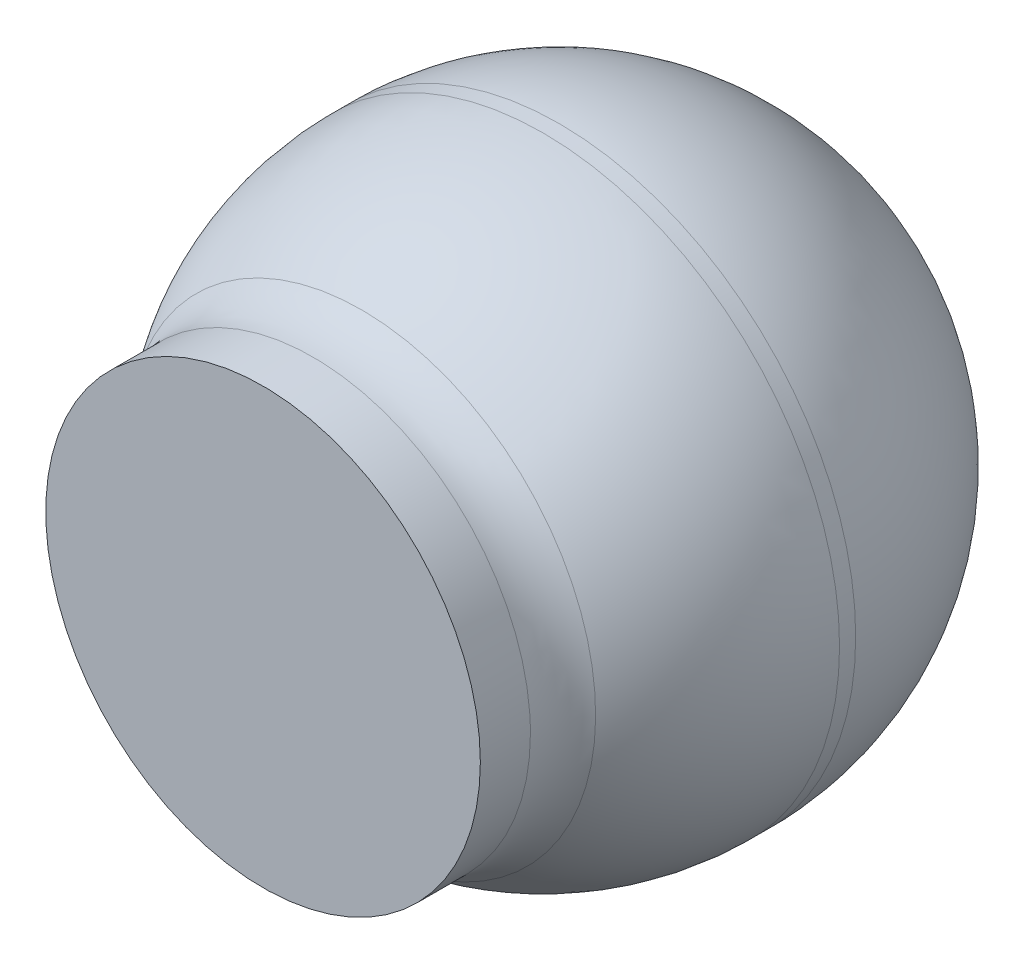
ISO-10303-21;
HEADER;
FILE_DESCRIPTION(('STEP AP214'),'2;1');
FILE_NAME('part.step','',(''),(''),'','','');
FILE_SCHEMA(('AUTOMOTIVE_DESIGN { 1 0 10303 214 1 1 1 1 }'));
ENDSEC;
DATA;
#1=APPLICATION_CONTEXT('core data for automotive mechanical design processes');
#2=APPLICATION_PROTOCOL_DEFINITION('international standard','automotive_design',2000,#1);
#3=PRODUCT_CONTEXT('',#1,'mechanical');
#4=PRODUCT('Part','Part','',(#3));
#5=PRODUCT_RELATED_PRODUCT_CATEGORY('part','',(#4));
#6=PRODUCT_DEFINITION_FORMATION('','',#4);
#7=PRODUCT_DEFINITION_CONTEXT('part definition',#1,'design');
#8=PRODUCT_DEFINITION('design','',#6,#7);
#9=PRODUCT_DEFINITION_SHAPE('','',#8);
#10=(LENGTH_UNIT() NAMED_UNIT(*) SI_UNIT(.MILLI.,.METRE.));
#11=(NAMED_UNIT(*) PLANE_ANGLE_UNIT() SI_UNIT($,.RADIAN.));
#12=(NAMED_UNIT(*) SI_UNIT($,.STERADIAN.) SOLID_ANGLE_UNIT());
#13=UNCERTAINTY_MEASURE_WITH_UNIT(LENGTH_MEASURE(1.E-05),#10,'distance_accuracy_value','');
#14=(GEOMETRIC_REPRESENTATION_CONTEXT(3) GLOBAL_UNCERTAINTY_ASSIGNED_CONTEXT((#13)) GLOBAL_UNIT_ASSIGNED_CONTEXT((#10,
#11,#12)) REPRESENTATION_CONTEXT('',''));
#15=CARTESIAN_POINT('',(0.,0.,0.));
#16=DIRECTION('',(0.,0.,1.));
#17=DIRECTION('',(1.,0.,0.));
#18=AXIS2_PLACEMENT_3D('',#15,#16,#17);
#19=CARTESIAN_POINT('',(-5.642919922269,-2.781349291452,10.006534503384));
#20=DIRECTION('',(0.,0.,-1.));
#21=DIRECTION('',(-1.,0.,0.));
#22=AXIS2_PLACEMENT_3D('',#19,#20,#21);
#23=PLANE('',#22);
#24=CARTESIAN_POINT('',(-5.642919922269,-2.781349291452,10.006534503384));
#25=DIRECTION('',(0.,0.,1.));
#26=DIRECTION('',(1.,0.,0.));
#27=AXIS2_PLACEMENT_3D('',#24,#25,#26);
#28=CIRCLE('',#27,0.275);
#29=CARTESIAN_POINT('',(-5.367919922269,-2.781349291452,10.006534503384));
#30=VERTEX_POINT('',#29);
#31=EDGE_CURVE('E20',#30,#30,#28,.F.);
#32=ORIENTED_EDGE('',*,*,#31,.F.);
#33=EDGE_LOOP('',(#32));
#34=FACE_BOUND('',#33,.T.);
#35=ADVANCED_FACE('F17',(#34),#23,.F.);
#36=CARTESIAN_POINT('',(-5.642919922269,-2.781349291452,9.906534503384));
#37=DIRECTION('',(0.,0.,1.));
#38=DIRECTION('',(1.,0.,0.));
#39=AXIS2_PLACEMENT_3D('',#36,#37,#38);
#40=CYLINDRICAL_SURFACE('',#39,0.275);
#41=CARTESIAN_POINT('',(-5.642919922269,-2.781349291452,9.943180457728));
#42=DIRECTION('',(0.,0.,-1.));
#43=DIRECTION('',(0.996700902337582,0.0811622527992454,0.));
#44=AXIS2_PLACEMENT_3D('',#41,#42,#43);
#45=CIRCLE('',#44,0.275);
#46=CARTESIAN_POINT('',(-5.36882717412616,-2.75902967193221,9.943180457728));
#47=VERTEX_POINT('',#46);
#48=EDGE_CURVE('E65',#47,#47,#45,.F.);
#49=ORIENTED_EDGE('',*,*,#48,.T.);
#50=EDGE_LOOP('',(#49));
#51=FACE_BOUND('',#50,.T.);
#52=ORIENTED_EDGE('',*,*,#31,.T.);
#53=EDGE_LOOP('',(#52));
#54=FACE_BOUND('',#53,.T.);
#55=ADVANCED_FACE('F62',(#51,#54),#40,.T.);
#56=CARTESIAN_POINT('',(-5.642919922269,-2.781349291452,9.943180457728));
#57=DIRECTION('',(0.,0.,-1.));
#58=DIRECTION('',(0.996700902337583,0.081162252799246,0.));
#59=AXIS2_PLACEMENT_3D('',#56,#57,#58);
#60=TOROIDAL_SURFACE('',#59,0.375,0.1);
#61=ORIENTED_EDGE('',*,*,#48,.F.);
#62=EDGE_LOOP('',(#61));
#63=FACE_BOUND('',#62,.T.);
#64=CARTESIAN_POINT('',(-5.642919922269,-2.781349291452,9.881744931236));
#65=DIRECTION('',(0.,0.,-1.));
#66=DIRECTION('',(-0.996700902337598,-0.0811622527990605,0.));
#67=AXIS2_PLACEMENT_3D('',#64,#65,#66);
#68=CIRCLE('',#67,0.296097046412666);
#69=CARTESIAN_POINT('',(-5.938040115608,-2.805381194786,9.881744931236));
#70=VERTEX_POINT('',#69);
#71=EDGE_CURVE('E39',#70,#70,#68,.T.);
#72=ORIENTED_EDGE('',*,*,#71,.F.);
#73=EDGE_LOOP('',(#72));
#74=FACE_BOUND('',#73,.T.);
#75=ADVANCED_FACE('F57',(#63,#74),#60,.F.);
#76=CARTESIAN_POINT('',(-6.016682760645,-2.811785136252,9.651976062157));
#77=CARTESIAN_POINT('',(-6.016682760645,-2.811785136252,9.701461392103));
#78=CARTESIAN_POINT('',(-6.008526217348,-2.811120941579,9.750947004335));
#79=CARTESIAN_POINT('',(-5.992207085349,-2.809792059952,9.798626332798));
#80=CARTESIAN_POINT('',(-5.968341390838,-2.807848654938,9.842699544317));
#81=CARTESIAN_POINT('',(-5.938040115608,-2.805381194786,9.881744931236));
#82=(BOUNDED_CURVE() B_SPLINE_CURVE(5,(#76,#77,#78,#79,#80,#81),.UNSPECIFIED.,.F.,
.F.) B_SPLINE_CURVE_WITH_KNOTS((6,6),(0.,0.661568582165),
.UNSPECIFIED.) CURVE() GEOMETRIC_REPRESENTATION_ITEM() RATIONAL_B_SPLINE_CURVE((1.,1.,1.,1.,1.,1.)) REPRESENTATION_ITEM(''));
#83=CARTESIAN_POINT('',(-5.642919922269,-2.781349291452,9.651976062157));
#84=DIRECTION('',(0.,0.,-1.));
#85=AXIS1_PLACEMENT('',#83,#84);
#86=SURFACE_OF_REVOLUTION('',#82,#85);
#87=CARTESIAN_POINT('',(-5.642919922269,-2.781349291452,9.651976062157));
#88=DIRECTION('',(0.,0.,1.));
#89=DIRECTION('',(1.,0.,0.));
#90=AXIS2_PLACEMENT_3D('',#87,#88,#89);
#91=CIRCLE('',#90,0.375);
#92=CARTESIAN_POINT('',(-5.267919922269,-2.781349291452,9.651976062157));
#93=VERTEX_POINT('',#92);
#94=EDGE_CURVE('E36',#93,#93,#91,.F.);
#95=ORIENTED_EDGE('',*,*,#94,.F.);
#96=EDGE_LOOP('',(#95));
#97=FACE_BOUND('',#96,.T.);
#98=ORIENTED_EDGE('',*,*,#71,.T.);
#99=EDGE_LOOP('',(#98));
#100=FACE_BOUND('',#99,.T.);
#101=ADVANCED_FACE('F53',(#97,#100),#86,.F.);
#102=CARTESIAN_POINT('',(-5.642919922269,-2.781349291452,9.256534503384));
#103=DIRECTION('',(0.,0.,1.));
#104=DIRECTION('',(1.,0.,0.));
#105=AXIS2_PLACEMENT_3D('',#102,#103,#104);
#106=CYLINDRICAL_SURFACE('',#105,0.375);
#107=CARTESIAN_POINT('',(-5.642919922269,-2.781349291452,9.631534503384));
#108=DIRECTION('',(0.,0.,-1.));
#109=DIRECTION('',(0.0811622527992356,-0.996700902337583,0.));
#110=AXIS2_PLACEMENT_3D('',#107,#108,#109);
#111=CIRCLE('',#110,0.375);
#112=CARTESIAN_POINT('',(-5.61248407746929,-3.15511212982859,9.631534503384));
#113=VERTEX_POINT('',#112);
#114=CARTESIAN_POINT('',(-5.67335576706871,-2.40758645307541,9.631534503384));
#115=VERTEX_POINT('',#114);
#116=EDGE_CURVE('E11',#113,#115,#111,.T.);
#117=ORIENTED_EDGE('',*,*,#116,.F.);
#118=CARTESIAN_POINT('',(-5.642919922269,-2.781349291452,9.631534503384));
#119=DIRECTION('',(0.,0.,1.));
#120=DIRECTION('',(0.0811622527992366,-0.996700902337583,0.));
#121=AXIS2_PLACEMENT_3D('',#118,#119,#120);
#122=CIRCLE('',#121,0.375);
#123=EDGE_CURVE('E25',#115,#113,#122,.F.);
#124=ORIENTED_EDGE('',*,*,#123,.F.);
#125=EDGE_LOOP('',(#117,#124));
#126=FACE_BOUND('',#125,.T.);
#127=ORIENTED_EDGE('',*,*,#94,.T.);
#128=EDGE_LOOP('',(#127));
#129=FACE_BOUND('',#128,.T.);
#130=ADVANCED_FACE('F34',(#126,#129),#106,.T.);
#131=CARTESIAN_POINT('',(-5.642919922269,-2.781349291452,9.631534503384));
#132=DIRECTION('',(0.0811622527992361,-0.996700902337583,0.));
#133=DIRECTION('',(-0.996700902337583,-0.0811622527992361,0.));
#134=AXIS2_PLACEMENT_3D('',#131,#132,#133);
#135=SPHERICAL_SURFACE('',#134,0.375);
#136=ORIENTED_EDGE('',*,*,#123,.T.);
#137=ORIENTED_EDGE('',*,*,#116,.T.);
#138=EDGE_LOOP('',(#136,#137));
#139=FACE_BOUND('',#138,.T.);
#140=ADVANCED_FACE('F32',(#139),#135,.T.);
#141=CLOSED_SHELL('',(#35,#55,#75,#101,#130,#140));
#142=MANIFOLD_SOLID_BREP('B1',#141);
#143=ADVANCED_BREP_SHAPE_REPRESENTATION('',(#18,#142),#14);
#144=SHAPE_DEFINITION_REPRESENTATION(#9,#143);
ENDSEC;
END-ISO-10303-21;
